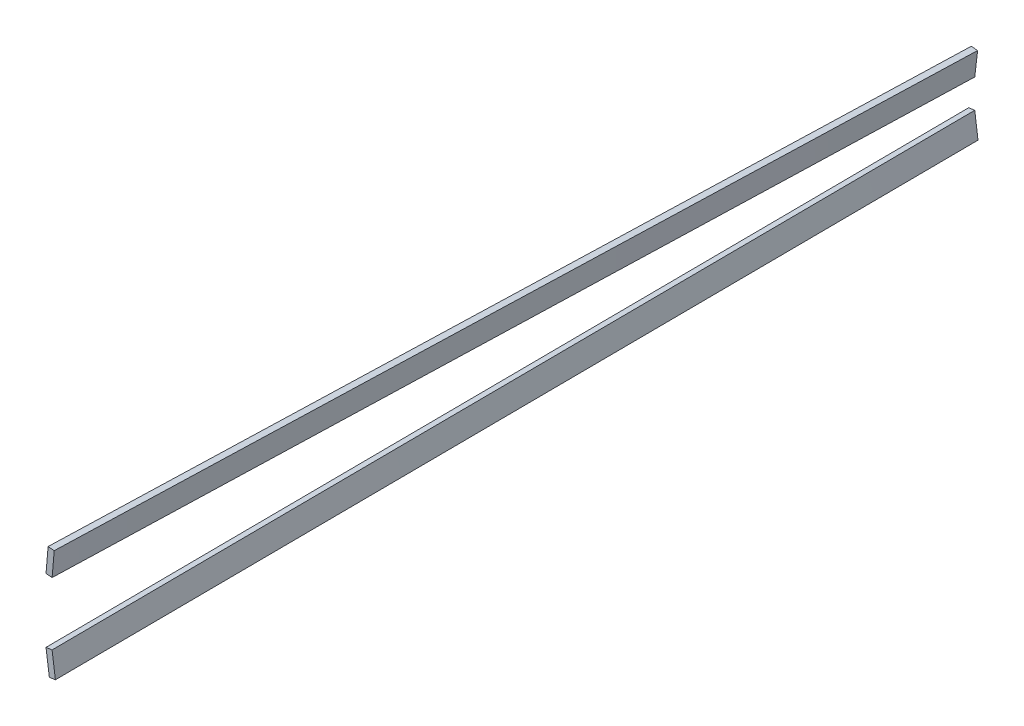
ISO-10303-21;
HEADER;
FILE_DESCRIPTION(('STEP AP214'),'2;1');
FILE_NAME('part.step','',(''),(''),'','','');
FILE_SCHEMA(('AUTOMOTIVE_DESIGN { 1 0 10303 214 1 1 1 1 }'));
ENDSEC;
DATA;
#1=APPLICATION_CONTEXT('core data for automotive mechanical design processes');
#2=APPLICATION_PROTOCOL_DEFINITION('international standard','automotive_design',2000,#1);
#3=PRODUCT_CONTEXT('',#1,'mechanical');
#4=PRODUCT('Part','Part','',(#3));
#5=PRODUCT_RELATED_PRODUCT_CATEGORY('part','',(#4));
#6=PRODUCT_DEFINITION_FORMATION('','',#4);
#7=PRODUCT_DEFINITION_CONTEXT('part definition',#1,'design');
#8=PRODUCT_DEFINITION('design','',#6,#7);
#9=PRODUCT_DEFINITION_SHAPE('','',#8);
#10=(LENGTH_UNIT() NAMED_UNIT(*) SI_UNIT(.MILLI.,.METRE.));
#11=(NAMED_UNIT(*) PLANE_ANGLE_UNIT() SI_UNIT($,.RADIAN.));
#12=(NAMED_UNIT(*) SI_UNIT($,.STERADIAN.) SOLID_ANGLE_UNIT());
#13=UNCERTAINTY_MEASURE_WITH_UNIT(LENGTH_MEASURE(1.E-05),#10,'distance_accuracy_value','');
#14=(GEOMETRIC_REPRESENTATION_CONTEXT(3) GLOBAL_UNCERTAINTY_ASSIGNED_CONTEXT((#13)) GLOBAL_UNIT_ASSIGNED_CONTEXT((#10,
#11,#12)) REPRESENTATION_CONTEXT('',''));
#15=CARTESIAN_POINT('',(0.,0.,0.));
#16=DIRECTION('',(0.,0.,1.));
#17=DIRECTION('',(1.,0.,0.));
#18=AXIS2_PLACEMENT_3D('',#15,#16,#17);
#19=CARTESIAN_POINT('',(0.,0.,-478.663));
#20=DIRECTION('',(0.,0.,-1.));
#21=DIRECTION('',(-1.,0.,0.));
#22=AXIS2_PLACEMENT_3D('',#19,#20,#21);
#23=PLANE('',#22);
#24=DIRECTION('',(0.99120712690939,0.132319430032148,0.));
#25=VECTOR('',#24,1.);
#26=CARTESIAN_POINT('',(3.15823560704575,-23.6583972694122,-478.663));
#27=LINE('',#26,#25);
#28=CARTESIAN_POINT('',(293.325645427331,15.0769843062237,-478.663));
#29=VERTEX_POINT('',#28);
#30=CARTESIAN_POINT('',(296.472728055268,15.4970984965758,-478.663));
#31=VERTEX_POINT('',#30);
#32=EDGE_CURVE('E236',#29,#31,#27,.T.);
#33=ORIENTED_EDGE('',*,*,#32,.T.);
#34=DIRECTION('',(0.131985681946742,-0.991251622828963,0.));
#35=VECTOR('',#34,1.);
#36=CARTESIAN_POINT('',(293.335609063056,39.0577927034886,-478.663));
#37=LINE('',#36,#35);
#38=CARTESIAN_POINT('',(298.149010473727,2.90772029199698,-478.663));
#39=VERTEX_POINT('',#38);
#40=EDGE_CURVE('E141',#31,#39,#37,.T.);
#41=ORIENTED_EDGE('',*,*,#40,.T.);
#42=CARTESIAN_POINT('',(423.387562730416,-0.598570683459927,-478.663));
#43=CARTESIAN_POINT('',(423.353927756293,-0.591395979490775,-478.663));
#44=CARTESIAN_POINT('',(423.21931714752,-0.562682079919149,-478.663));
#45=CARTESIAN_POINT('',(422.91635344577,-0.499447587671617,-478.663));
#46=CARTESIAN_POINT('',(422.412228818172,-0.393180215829817,-478.663));
#47=CARTESIAN_POINT('',(421.70748859617,-0.247042835446236,-478.663));
#48=CARTESIAN_POINT('',(420.803524813709,-0.0608019669566655,-478.663));
#49=CARTESIAN_POINT('',(419.701710383377,0.162485176428392,-478.663));
#50=CARTESIAN_POINT('',(418.403969401873,0.42193723491887,-478.663));
#51=CARTESIAN_POINT('',(416.912204339275,0.713898906283567,-478.663));
#52=CARTESIAN_POINT('',(415.229189009072,1.03708195332995,-478.663));
#53=CARTESIAN_POINT('',(413.357174388221,1.38616016731921,-478.663));
#54=CARTESIAN_POINT('',(411.299857620068,1.75939956386392,-478.663));
#55=CARTESIAN_POINT('',(409.060092771815,2.15209085915427,-478.663));
#56=CARTESIAN_POINT('',(406.641766459114,2.56039912737651,-478.663));
#57=CARTESIAN_POINT('',(404.04866688,2.98050952034267,-478.663));
#58=CARTESIAN_POINT('',(401.284982811694,3.40684602860176,-478.663));
#59=CARTESIAN_POINT('',(398.355056245213,3.83534149622065,-478.663));
#60=CARTESIAN_POINT('',(395.263527571514,4.26052524747009,-478.663));
#61=CARTESIAN_POINT('',(392.015373204561,4.67808858830662,-478.663));
#62=CARTESIAN_POINT('',(388.615478958681,5.08116931638825,-478.663));
#63=CARTESIAN_POINT('',(385.069286638117,5.46711366951576,-478.663));
#64=CARTESIAN_POINT('',(381.381970635892,5.82783453396013,-478.663));
#65=CARTESIAN_POINT('',(377.559192932435,6.15921060948389,-478.663));
#66=CARTESIAN_POINT('',(373.606851586853,6.45639091976692,-478.663));
#67=CARTESIAN_POINT('',(369.530453947723,6.71243770640048,-478.663));
#68=CARTESIAN_POINT('',(365.336119949899,6.92357395440403,-478.663));
#69=CARTESIAN_POINT('',(361.029807140813,7.08404404844039,-478.663));
#70=CARTESIAN_POINT('',(356.617523340991,7.18843396947195,-478.663));
#71=CARTESIAN_POINT('',(352.105426545498,7.23205813156872,-478.663));
#72=CARTESIAN_POINT('',(347.499385223467,7.21140010703142,-478.663));
#73=CARTESIAN_POINT('',(342.80568645406,7.11987185636663,-478.663));
#74=CARTESIAN_POINT('',(338.030192719595,6.95515066970667,-478.663));
#75=CARTESIAN_POINT('',(333.178936205884,6.71234985379041,-478.663));
#76=CARTESIAN_POINT('',(328.257698607244,6.38807962814831,-478.663));
#77=CARTESIAN_POINT('',(323.272118603679,5.98002284945519,-478.663));
#78=CARTESIAN_POINT('',(318.228182783313,5.48230898932139,-478.663));
#79=CARTESIAN_POINT('',(313.120651689801,4.89918891009641,-478.663));
#80=CARTESIAN_POINT('',(307.869311436917,4.18787475782382,-478.663));
#81=CARTESIAN_POINT('',(302.45646596458,3.48111483212754,-478.663));
#82=CARTESIAN_POINT('',(296.896259161603,2.74127410511817,-478.663));
#83=CARTESIAN_POINT('',(291.277526125806,1.99080851277614,-478.663));
#84=CARTESIAN_POINT('',(285.605919767471,1.22943621224605,-478.663));
#85=CARTESIAN_POINT('',(279.887290637041,0.457639017885714,-478.663));
#86=CARTESIAN_POINT('',(274.127034046233,-0.323609112130179,-478.663));
#87=CARTESIAN_POINT('',(268.330669910689,-1.11197613327778,-478.663));
#88=CARTESIAN_POINT('',(262.503543084913,-1.90586372829593,-478.663));
#89=CARTESIAN_POINT('',(256.651521274952,-2.70536888716537,-478.663));
#90=CARTESIAN_POINT('',(250.779899054847,-3.50651782193096,-478.663));
#91=CARTESIAN_POINT('',(244.894427750941,-4.30923724123935,-478.663));
#92=CARTESIAN_POINT('',(239.000567191879,-5.11132357461406,-478.663));
#93=CARTESIAN_POINT('',(233.103498264235,-5.90945278003363,-478.663));
#94=CARTESIAN_POINT('',(227.208964765834,-6.70337919450948,-478.663));
#95=CARTESIAN_POINT('',(221.322423209652,-7.49063506944608,-478.663));
#96=CARTESIAN_POINT('',(215.448997430527,-8.26717151250937,-478.663));
#97=CARTESIAN_POINT('',(209.594351574101,-9.03362813673483,-478.663));
#98=CARTESIAN_POINT('',(203.763409799043,-9.78454417055984,-478.663));
#99=CARTESIAN_POINT('',(197.96163086993,-10.5200053400287,-478.663));
#100=CARTESIAN_POINT('',(192.194232926486,-11.2365486354174,-478.663));
#101=CARTESIAN_POINT('',(186.466038684059,-11.9314142369755,-478.663));
#102=CARTESIAN_POINT('',(180.782436918827,-12.603274502764,-478.663));
#103=CARTESIAN_POINT('',(175.148233734479,-13.2482933836929,-478.663));
#104=CARTESIAN_POINT('',(169.568575962817,-13.8653038852164,-478.663));
#105=CARTESIAN_POINT('',(164.048210174808,-14.4510142998016,-478.663));
#106=CARTESIAN_POINT('',(158.592053261258,-15.0035265840128,-478.663));
#107=CARTESIAN_POINT('',(153.204921249941,-15.5202417100007,-478.663));
#108=CARTESIAN_POINT('',(147.891468535792,-15.9995243592631,-478.663));
#109=CARTESIAN_POINT('',(142.656399146351,-16.4389751743704,-478.663));
#110=CARTESIAN_POINT('',(137.504278758819,-16.8360326338407,-478.663));
#111=CARTESIAN_POINT('',(132.439787601187,-17.1897064470047,-478.663));
#112=CARTESIAN_POINT('',(127.467323045722,-17.4971602641448,-478.663));
#113=CARTESIAN_POINT('',(122.591261031339,-17.7570314908688,-478.663));
#114=CARTESIAN_POINT('',(117.815974853389,-17.9684391095265,-478.663));
#115=CARTESIAN_POINT('',(113.145771879521,-18.1292556955295,-478.663));
#116=CARTESIAN_POINT('',(108.584868364175,-18.2375350386864,-478.663));
#117=CARTESIAN_POINT('',(104.137640996795,-18.2939630983556,-478.663));
#118=CARTESIAN_POINT('',(99.8078887735024,-18.2954225965007,-478.663));
#119=CARTESIAN_POINT('',(95.5998472131619,-18.2423038335932,-478.663));
#120=CARTESIAN_POINT('',(91.5173192139185,-18.1338093844727,-478.663));
#121=CARTESIAN_POINT('',(87.5643031381508,-17.9682478198103,-478.663));
#122=CARTESIAN_POINT('',(83.7445855660069,-17.746248509974,-478.663));
#123=CARTESIAN_POINT('',(80.061874223133,-17.4671075395393,-478.663));
#124=CARTESIAN_POINT('',(76.519839715575,-17.13063972547,-478.663));
#125=CARTESIAN_POINT('',(73.1219854837755,-16.7361212710426,-478.663));
#126=CARTESIAN_POINT('',(69.8716450566022,-16.2843801388157,-478.663));
#127=CARTESIAN_POINT('',(66.7721547003917,-15.7751336760586,-478.663));
#128=CARTESIAN_POINT('',(63.8267343373244,-15.2086669368191,-478.663));
#129=CARTESIAN_POINT('',(61.0385935681709,-14.5844044129643,-478.663));
#130=CARTESIAN_POINT('',(58.4104140498924,-13.9039395891707,-478.663));
#131=CARTESIAN_POINT('',(55.9451842927062,-13.1663213913398,-478.663));
#132=CARTESIAN_POINT('',(53.6452481034751,-12.3733473758183,-478.663));
#133=CARTESIAN_POINT('',(51.513417248505,-11.5238097949324,-478.663));
#134=CARTESIAN_POINT('',(49.5520143575696,-10.6188443549477,-478.663));
#135=CARTESIAN_POINT('',(47.7628278881901,-9.65873376201667,-478.663));
#136=CARTESIAN_POINT('',(46.147868828537,-8.64407502954019,-478.663));
#137=CARTESIAN_POINT('',(44.7094832235471,-7.57379097901466,-478.663));
#138=CARTESIAN_POINT('',(43.4495535636796,-6.44836880629533,-478.663));
#139=CARTESIAN_POINT('',(42.3693155768158,-5.26841350717316,-478.663));
#140=CARTESIAN_POINT('',(41.4711549763534,-4.03269789142648,-478.663));
#141=CARTESIAN_POINT('',(40.7610437619866,-2.74155962108168,-478.663));
#142=CARTESIAN_POINT('',(40.2240782562071,-1.39842829488874,-478.663));
#143=CARTESIAN_POINT('',(40.026437002402,-0.465429755628102,-478.663));
#144=CARTESIAN_POINT('',(39.9278429354344,0.,-478.663));
#145=B_SPLINE_CURVE_WITH_KNOTS('',3,(#42,#43,#44,#45,#46,#47,#48,#49,#50,#51,#52,#53,#54,#55,
#56,#57,#58,#59,#60,#61,#62,#63,#64,#65,#66,#67,#68,#69,#70,#71,#72,#73,#74,#75,#76,#77,#78,#79,
#80,#81,#82,#83,#84,#85,#86,#87,#88,#89,#90,#91,#92,#93,#94,#95,#96,#97,#98,#99,#100,#101,#102,
#103,#104,#105,#106,#107,#108,#109,#110,#111,#112,#113,#114,#115,#116,#117,#118,#119,#120,#121,
#122,#123,#124,#125,#126,#127,#128,#129,#130,#131,#132,#133,#134,#135,#136,#137,#138,#139,#140,
#141,#142,#143,#144),.UNSPECIFIED.,.F.,.F.,(4,1,1,1,1,1,1,1,1,1,1,1,1,1,1,1,1,1,1,1,1,1,1,1,1,1,
1,1,1,1,1,1,1,1,1,1,1,1,1,1,1,1,1,1,1,1,1,1,1,1,1,1,1,1,1,1,1,1,1,1,1,1,1,1,1,1,1,1,1,1,1,1,1,1,
1,1,1,1,1,1,1,1,1,1,1,1,1,1,1,1,1,1,1,1,1,1,1,1,1,1,4),(0.,0.000263407441861152,
0.00105418354046938,0.002370412180423,0.00420937424793744,0.00656664230364534,
0.00943932529828362,0.012819753789679,0.0167027815540403,0.0210815676778737,0.0259455150023407,
0.0312877118873262,0.0370957960416438,0.0433615353737737,0.0500718116741128,0.0572152612400396,
0.0647788957380719,0.0727507221098705,0.0811160233175952,0.0898610226345078,0.0989726352727727,
0.108436394956907,0.11823658628776,0.128360674312887,0.138792302715597,0.149518641338252,
0.160525099370816,0.171796475500045,0.183320915835009,0.195083958581768,0.207073471204003,
0.219275662182765,0.231680048251389,0.244274442260697,0.257047871769566,0.269990725638771,
0.283092436221423,0.296418175051444,0.310577141849346,0.324901812537067,0.339379315631893,
0.353993476069731,0.368730577460443,0.383575671255915,0.398515484082567,0.413533959391771,
0.428618215440677,0.44375276659731,0.458921685899164,0.474112665452042,0.489310225086662,
0.504499416623933,0.519666846056783,0.534796932326458,0.549875724286475,0.564890467250726,
0.579825176535041,0.594667406411289,0.609402807723467,0.624019253145754,0.638501397294299,
0.652837209492562,0.667014500967881,0.68101931479257,0.694839720321596,0.708463964765985,
0.721880297346092,0.735076105433477,0.748040996187331,0.760763583019831,0.773232750583482,
0.785439521795172,0.797373026110578,0.80902262678145,0.820380871717842,0.83143652712263,
0.842183519415127,0.852612082472283,0.86271472951419,0.872485157300502,0.881915470474977,
0.891000132552545,0.899734087744223,0.908112589055665,0.916131607778471,0.923788842688074,
0.931081963902189,0.938011213981012,0.944577653857526,0.950785321002633,0.956638125291176,
0.962146840114847,0.967320917546812,0.972179373952079,0.9767415246109,0.981036728216416,
0.985098918921906,0.988971863590748,0.992706768868038,0.996361744803825,1.),.UNSPECIFIED.);
#146=CARTESIAN_POINT('',(295.006102188739,2.48865379447443,-478.663));
#147=VERTEX_POINT('',#146);
#148=EDGE_CURVE('E99',#39,#147,#145,.T.);
#149=ORIENTED_EDGE('',*,*,#148,.T.);
#150=DIRECTION('',(-0.132319430032147,0.99120712690939,0.));
#151=VECTOR('',#150,1.);
#152=CARTESIAN_POINT('',(290.167409820285,38.7353815756355,-478.663));
#153=LINE('',#152,#151);
#154=EDGE_CURVE('E13',#147,#29,#153,.T.);
#155=ORIENTED_EDGE('',*,*,#154,.T.);
#156=EDGE_LOOP('',(#33,#41,#149,#155));
#157=FACE_BOUND('',#156,.T.);
#158=ADVANCED_FACE('F89',(#157),#23,.T.);
#159=CARTESIAN_POINT('',(0.,0.,0.));
#160=DIRECTION('',(0.,0.,1.));
#161=DIRECTION('',(1.,0.,0.));
#162=AXIS2_PLACEMENT_3D('',#159,#160,#161);
#163=PLANE('',#162);
#164=DIRECTION('',(-0.134658441587376,0.99089207490486,0.));
#165=VECTOR('',#164,1.);
#166=CARTESIAN_POINT('',(289.604328188599,39.3561201047853,0.));
#167=LINE('',#166,#165);
#168=CARTESIAN_POINT('',(295.036807925605,-0.619102057485672,0.));
#169=VERTEX_POINT('',#168);
#170=CARTESIAN_POINT('',(293.326645717445,11.965227293806,0.));
#171=VERTEX_POINT('',#170);
#172=EDGE_CURVE('E203',#169,#171,#167,.T.);
#173=ORIENTED_EDGE('',*,*,#172,.F.);
#174=CARTESIAN_POINT('',(272.758362456909,-3.65581401828483,0.));
#175=CARTESIAN_POINT('',(273.323038862609,-3.57873827863166,0.));
#176=CARTESIAN_POINT('',(276.358796537806,-3.16431991771855,0.));
#177=CARTESIAN_POINT('',(281.854781180959,-2.41345663349635,0.));
#178=CARTESIAN_POINT('',(289.233859631028,-1.40813120619887,0.));
#179=CARTESIAN_POINT('',(296.573982386272,-0.409796640262891,0.));
#180=CARTESIAN_POINT('',(303.868380953239,0.579522999615512,0.));
#181=CARTESIAN_POINT('',(311.110065241189,1.55687474975404,0.));
#182=CARTESIAN_POINT('',(318.292203182046,2.52102495297771,0.));
#183=CARTESIAN_POINT('',(325.4073859189,3.47136371656061,0.));
#184=CARTESIAN_POINT('',(332.44845494126,4.40824789663675,0.));
#185=CARTESIAN_POINT('',(339.302915498252,5.30324075895215,0.));
#186=CARTESIAN_POINT('',(345.952856872452,6.20400082385384,0.));
#187=CARTESIAN_POINT('',(352.420688138379,6.94242450405157,0.));
#188=CARTESIAN_POINT('',(358.807986620489,7.57269564144798,0.));
#189=CARTESIAN_POINT('',(365.121387221388,8.08943105349519,0.));
#190=CARTESIAN_POINT('',(371.353308902841,8.50006492072197,0.));
#191=CARTESIAN_POINT('',(377.49661131128,8.80753139498866,0.));
#192=CARTESIAN_POINT('',(383.543972889456,9.01612314573799,0.));
#193=CARTESIAN_POINT('',(389.48775494647,9.13202833224759,0.));
#194=CARTESIAN_POINT('',(395.32053355087,9.15818824511355,0.));
#195=CARTESIAN_POINT('',(401.034347101245,9.10294556265715,0.));
#196=CARTESIAN_POINT('',(406.621764276995,8.97075324664186,0.));
#197=CARTESIAN_POINT('',(412.074986887718,8.767544826529,0.));
#198=CARTESIAN_POINT('',(417.386407281049,8.50017614669937,0.));
#199=CARTESIAN_POINT('',(422.54848099331,8.17593591941227,0.));
#200=CARTESIAN_POINT('',(427.553458196633,7.7996068660397,0.));
#201=CARTESIAN_POINT('',(432.394364707136,7.37997464832547,0.));
#202=CARTESIAN_POINT('',(437.063731759505,6.92318223197591,0.));
#203=CARTESIAN_POINT('',(441.554389355166,6.43444848566638,0.));
#204=CARTESIAN_POINT('',(445.859785012227,5.92401425015461,0.));
#205=CARTESIAN_POINT('',(449.973027478112,5.39524044171832,0.));
#206=CARTESIAN_POINT('',(453.887929886094,4.85681652022216,0.));
#207=CARTESIAN_POINT('',(457.598190253226,4.3141988780929,0.));
#208=CARTESIAN_POINT('',(461.097932514302,3.77431529482507,0.));
#209=CARTESIAN_POINT('',(464.381658047561,3.24231589208937,0.));
#210=CARTESIAN_POINT('',(467.444062606876,2.72526199021861,0.));
#211=CARTESIAN_POINT('',(470.280349075582,2.22798434817506,0.));
#212=CARTESIAN_POINT('',(472.885595604198,1.75533932329177,0.));
#213=CARTESIAN_POINT('',(475.256188039839,1.31329025898222,0.));
#214=CARTESIAN_POINT('',(477.38744454002,0.90403319739814,0.));
#215=CARTESIAN_POINT('',(479.276514699606,0.534312721305988,0.));
#216=CARTESIAN_POINT('',(480.919885908922,0.205760172731364,0.));
#217=CARTESIAN_POINT('',(482.315149055207,-0.0769954375130829,0.));
#218=CARTESIAN_POINT('',(483.459867496382,-0.312838295328672,0.));
#219=CARTESIAN_POINT('',(484.352302675222,-0.497896753791792,0.));
#220=CARTESIAN_POINT('',(484.990691913051,-0.632466588116719,0.));
#221=CARTESIAN_POINT('',(485.374344699791,-0.712542464675102,0.));
#222=CARTESIAN_POINT('',(485.544806570126,-0.748903782973926,0.));
#223=CARTESIAN_POINT('',(485.587399664,-0.757989340000014,0.));
#224=B_SPLINE_CURVE_WITH_KNOTS('',3,(#174,#175,#176,#177,#178,#179,#180,#181,#182,#183,#184,
#185,#186,#187,#188,#189,#190,#191,#192,#193,#194,#195,#196,#197,#198,#199,#200,#201,#202,#203,
#204,#205,#206,#207,#208,#209,#210,#211,#212,#213,#214,#215,#216,#217,#218,#219,#220,#221,#222,
#223),.UNSPECIFIED.,.F.,.F.,(4,1,1,1,1,1,1,1,1,1,1,1,1,1,1,1,1,1,1,1,1,1,1,1,1,1,1,1,1,1,1,1,1,
1,1,1,1,1,1,1,1,1,1,1,1,1,1,4),(0.567934832207434,0.571381784609285,0.586466040212324,
0.601484515504651,0.616424328656068,0.631269422567314,0.646006523660011,0.660620684024748,
0.675098187725839,0.689422858106043,0.70358182449163,0.716907563519481,0.730009274307503,
0.742952128081458,0.755725557616091,0.768319951608713,0.780724337258785,0.792926528422221,
0.804916041149194,0.816679083952964,0.828203524457021,0.839474900250967,0.850481358571424,
0.861207696842428,0.871639325898208,0.881763413748535,0.891563604612636,0.901027364470059,
0.910138977259583,0.918883976165486,0.927249277819328,0.935221103617664,0.94278473843867,
0.949928187937218,0.956638464326096,0.962904203571485,0.968712287841806,0.974054485103458,
0.978918431944735,0.983297218245018,0.987180245995965,0.990560674272218,0.993433357470946,
0.995790625593699,0.997629587292661,0.998945815779481,0.99973659231019,1.),.UNSPECIFIED.);
#225=CARTESIAN_POINT('',(298.182924105385,-0.19181053348416,0.));
#226=VERTEX_POINT('',#225);
#227=EDGE_CURVE('E161',#169,#226,#224,.T.);
#228=ORIENTED_EDGE('',*,*,#227,.T.);
#229=DIRECTION('',(0.134658441587371,-0.990892074904861,0.));
#230=VECTOR('',#229,1.);
#231=CARTESIAN_POINT('',(292.750410526422,39.7836606568238,0.));
#232=LINE('',#231,#230);
#233=CARTESIAN_POINT('',(296.472728055268,12.392767845846,0.));
#234=VERTEX_POINT('',#233);
#235=EDGE_CURVE('E137',#234,#226,#232,.T.);
#236=ORIENTED_EDGE('',*,*,#235,.F.);
#237=DIRECTION('',(0.99089207490486,0.13465844158738,0.));
#238=VECTOR('',#237,1.);
#239=CARTESIAN_POINT('',(3.72231752884665,-27.3908928109804,0.));
#240=LINE('',#239,#238);
#241=EDGE_CURVE('E148',#171,#234,#240,.T.);
#242=ORIENTED_EDGE('',*,*,#241,.F.);
#243=EDGE_LOOP('',(#173,#228,#236,#242));
#244=FACE_BOUND('',#243,.T.);
#245=ADVANCED_FACE('F160',(#244),#163,.T.);
#246=CARTESIAN_POINT('',(295.036807925605,-0.619102057485672,0.));
#247=CARTESIAN_POINT('',(295.006102188739,2.48865379447442,-478.663));
#248=CARTESIAN_POINT('',(294.751780890912,1.47828616772958,0.));
#249=CARTESIAN_POINT('',(294.726026061838,4.58670887976591,-478.663));
#250=CARTESIAN_POINT('',(294.466753856218,3.57567439294485,0.));
#251=CARTESIAN_POINT('',(294.445949934936,6.68476396505743,-478.663));
#252=CARTESIAN_POINT('',(293.896699786832,7.77045084337541,0.));
#253=CARTESIAN_POINT('',(293.885797681134,10.8808741356405,-478.663));
#254=CARTESIAN_POINT('',(293.611672752139,9.86783906859072,0.));
#255=CARTESIAN_POINT('',(293.605721554232,12.9789292209321,-478.663));
#256=CARTESIAN_POINT('',(293.326645717445,11.965227293806,0.));
#257=CARTESIAN_POINT('',(293.325645427331,15.0769843062237,-478.663));
#258=B_SPLINE_SURFACE_WITH_KNOTS('',3,1,((#246,#247),(#248,#249),(#250,#251),(#252,#253),(#254,
#255),(#256,#257)),.UNSPECIFIED.,.F.,.F.,.F.,(4,2,4),(2,2),(0.,0.5,1.),(0.,1.),.UNSPECIFIED.);
#259=DIRECTION('',(-2.08971442928665E-06,0.00650079755426387,-0.999978869590149));
#260=VECTOR('',#259,1.);
#261=CARTESIAN_POINT('',(293.326145572388,13.5211058000149,-239.3315));
#262=LINE('',#261,#260);
#263=EDGE_CURVE('E145',#171,#29,#262,.T.);
#264=DIRECTION('',(6.4147614595899E-05,-0.00649243903577054,0.999978921838081));
#265=VECTOR('',#264,1.);
#266=CARTESIAN_POINT('',(295.021455057172,0.934775868494372,-239.3315));
#267=LINE('',#266,#265);
#268=EDGE_CURVE('E114',#147,#169,#267,.T.);
#269=ORIENTED_EDGE('',*,*,#172,.T.);
#270=ORIENTED_EDGE('',*,*,#263,.T.);
#271=ORIENTED_EDGE('',*,*,#154,.F.);
#272=ORIENTED_EDGE('',*,*,#268,.T.);
#273=EDGE_LOOP('',(#269,#270,#271,#272));
#274=FACE_BOUND('',#273,.T.);
#275=ADVANCED_FACE('F180',(#274),#258,.T.);
#276=CARTESIAN_POINT('',(293.326645717445,11.9652272938061,0.));
#277=CARTESIAN_POINT('',(293.325645427331,15.0769843062237,-478.663));
#278=CARTESIAN_POINT('',(293.850992773749,12.0364840524794,0.));
#279=CARTESIAN_POINT('',(293.850159198654,15.1470033379491,-478.663));
#280=CARTESIAN_POINT('',(294.375339830053,12.1077408111527,0.));
#281=CARTESIAN_POINT('',(294.374672969977,15.2170223696745,-478.663));
#282=CARTESIAN_POINT('',(295.424033942661,12.2502543284993,0.));
#283=CARTESIAN_POINT('',(295.423700512623,15.3570604331252,-478.663));
#284=CARTESIAN_POINT('',(295.948380998964,12.3215110871727,0.));
#285=CARTESIAN_POINT('',(295.948214283946,15.4270794648505,-478.663));
#286=CARTESIAN_POINT('',(296.472728055268,12.392767845846,0.));
#287=CARTESIAN_POINT('',(296.472728055268,15.4970984965758,-478.663));
#288=B_SPLINE_SURFACE_WITH_KNOTS('',3,1,((#276,#277),(#278,#279),(#280,#281),(#282,#283),(#284,
#285),(#286,#287)),.UNSPECIFIED.,.F.,.F.,.F.,(4,2,4),(2,2),(0.,0.5,1.),(0.,1.),.UNSPECIFIED.);
#289=DIRECTION('',(0.,0.00648528373337653,-0.999978970326325));
#290=VECTOR('',#289,1.);
#291=CARTESIAN_POINT('',(296.472728055268,13.9449331712109,-239.3315));
#292=LINE('',#291,#290);
#293=EDGE_CURVE('E132',#234,#31,#292,.T.);
#294=ORIENTED_EDGE('',*,*,#241,.T.);
#295=ORIENTED_EDGE('',*,*,#293,.T.);
#296=ORIENTED_EDGE('',*,*,#32,.F.);
#297=ORIENTED_EDGE('',*,*,#263,.F.);
#298=EDGE_LOOP('',(#294,#295,#296,#297));
#299=FACE_BOUND('',#298,.T.);
#300=ADVANCED_FACE('F150',(#299),#288,.T.);
#301=CARTESIAN_POINT('',(298.182924105385,-0.191810533484172,0.));
#302=CARTESIAN_POINT('',(298.149010464063,2.90772029071021,-478.663000000001));
#303=CARTESIAN_POINT('',(297.77153606111,-0.247647448198452,0.));
#304=CARTESIAN_POINT('',(297.738036460832,2.85299888311781,-478.663));
#305=CARTESIAN_POINT('',(297.240415087317,-0.319755450715439,0.));
#306=CARTESIAN_POINT('',(297.207454639919,2.78229599082885,-478.663000000001));
#307=CARTESIAN_POINT('',(296.191708765441,-0.46217914367285,0.));
#308=CARTESIAN_POINT('',(296.159817101399,2.64261733002786,-478.663000000001));
#309=CARTESIAN_POINT('',(295.554390311453,-0.548764591644108,0.));
#310=CARTESIAN_POINT('',(295.523151527565,2.55767637507806,-478.663000000001));
#311=CARTESIAN_POINT('',(295.036807925605,-0.619102057485676,0.));
#312=CARTESIAN_POINT('',(295.006102188739,2.48865379447443,-478.663));
#313=B_SPLINE_SURFACE_WITH_KNOTS('',3,1,((#301,#302),(#303,#304),(#305,#306),(#307,#308),(#309,
#310),(#311,#312)),.UNSPECIFIED.,.F.,.F.,.F.,(4,1,1,4),(2,2),(0.,0.392277227659318,
0.506450563931673,1.),(0.,1.),.UNSPECIFIED.);
#314=DIRECTION('',(-7.08492626011175E-05,0.00647525678187677,-0.999979032795183));
#315=VECTOR('',#314,1.);
#316=CARTESIAN_POINT('',(298.165967289556,1.35795487925641,-239.3315));
#317=LINE('',#316,#315);
#318=EDGE_CURVE('E144',#226,#39,#317,.T.);
#319=ORIENTED_EDGE('',*,*,#227,.F.);
#320=ORIENTED_EDGE('',*,*,#268,.F.);
#321=ORIENTED_EDGE('',*,*,#148,.F.);
#322=ORIENTED_EDGE('',*,*,#318,.F.);
#323=EDGE_LOOP('',(#319,#320,#321,#322));
#324=FACE_BOUND('',#323,.T.);
#325=ADVANCED_FACE('F248',(#324),#313,.T.);
#326=CARTESIAN_POINT('',(296.472728055268,12.392767845846,0.));
#327=CARTESIAN_POINT('',(296.472728055268,15.4970984965758,-478.663));
#328=CARTESIAN_POINT('',(296.757760730288,10.2953381159576,0.));
#329=CARTESIAN_POINT('',(296.752108458345,13.3988687958126,-478.663));
#330=CARTESIAN_POINT('',(297.042793405307,8.19790838606931,0.));
#331=CARTESIAN_POINT('',(297.031488861421,11.3006390950495,-478.663));
#332=CARTESIAN_POINT('',(297.612858755346,4.0030489262926,0.));
#333=CARTESIAN_POINT('',(297.590249667574,7.10417969352324,-478.663));
#334=CARTESIAN_POINT('',(297.897891430366,1.90561919640423,0.));
#335=CARTESIAN_POINT('',(297.86963007065,5.00594999276011,-478.663));
#336=CARTESIAN_POINT('',(298.182924105385,-0.19181053348416,0.));
#337=CARTESIAN_POINT('',(298.149010473727,2.90772029199698,-478.663));
#338=B_SPLINE_SURFACE_WITH_KNOTS('',3,1,((#326,#327),(#328,#329),(#330,#331),(#332,#333),(#334,
#335),(#336,#337)),.UNSPECIFIED.,.F.,.F.,.F.,(4,2,4),(2,2),(0.,0.5,1.),(0.,1.),.UNSPECIFIED.);
#339=ORIENTED_EDGE('',*,*,#235,.T.);
#340=ORIENTED_EDGE('',*,*,#318,.T.);
#341=ORIENTED_EDGE('',*,*,#40,.F.);
#342=ORIENTED_EDGE('',*,*,#293,.F.);
#343=EDGE_LOOP('',(#339,#340,#341,#342));
#344=FACE_BOUND('',#343,.T.);
#345=ADVANCED_FACE('F134',(#344),#338,.T.);
#346=CLOSED_SHELL('',(#158,#245,#275,#300,#325,#345));
#347=MANIFOLD_SOLID_BREP('B2',#346);
#348=CARTESIAN_POINT('',(0.,0.,-478.663));
#349=DIRECTION('',(0.,0.,-1.));
#350=DIRECTION('',(-1.,0.,0.));
#351=AXIS2_PLACEMENT_3D('',#348,#349,#350);
#352=PLANE('',#351);
#353=DIRECTION('',(0.115362470191797,0.993323462156838,0.));
#354=VECTOR('',#353,1.);
#355=CARTESIAN_POINT('',(289.037781570803,-33.5682320322562,-478.663));
#356=LINE('',#355,#354);
#357=CARTESIAN_POINT('',(296.472728055268,30.4500467946571,-478.663));
#358=VERTEX_POINT('',#357);
#359=CARTESIAN_POINT('',(297.937186245587,43.0596993760035,-478.663));
#360=VERTEX_POINT('',#359);
#361=EDGE_CURVE('E562',#358,#360,#356,.T.);
#362=ORIENTED_EDGE('',*,*,#361,.F.);
#363=DIRECTION('',(0.993725072979922,-0.111850254049998,0.));
#364=VECTOR('',#363,1.);
#365=CARTESIAN_POINT('',(7.09348997460711,63.0215720345871,-478.663));
#366=LINE('',#365,#364);
#367=CARTESIAN_POINT('',(293.317650948557,30.8051713512659,-478.663));
#368=VERTEX_POINT('',#367);
#369=EDGE_CURVE('E554',#368,#358,#366,.T.);
#370=ORIENTED_EDGE('',*,*,#369,.F.);
#371=DIRECTION('',(-0.111850254049959,-0.993725072979926,0.));
#372=VECTOR('',#371,1.);
#373=CARTESIAN_POINT('',(286.224160973954,-32.2164006833102,-478.663));
#374=LINE('',#373,#372);
#375=CARTESIAN_POINT('',(294.738149184402,43.4254797770516,-478.663000000001));
#376=VERTEX_POINT('',#375);
#377=EDGE_CURVE('E433',#376,#368,#374,.T.);
#378=ORIENTED_EDGE('',*,*,#377,.F.);
#379=CARTESIAN_POINT('',(39.9278429354344,0.,-478.663));
#380=CARTESIAN_POINT('',(39.8657355030388,0.471738861701327,-478.663));
#381=CARTESIAN_POINT('',(39.7412418233404,1.41733433207799,-478.663));
#382=CARTESIAN_POINT('',(39.8014992306979,2.86293780882031,-478.663));
#383=CARTESIAN_POINT('',(40.0435881073942,4.31743973085277,-478.663));
#384=CARTESIAN_POINT('',(40.4858457955378,5.78200614021087,-478.663));
#385=CARTESIAN_POINT('',(41.1210865702239,7.25447537763585,-478.663));
#386=CARTESIAN_POINT('',(41.9499403425719,8.73401937480033,-478.663));
#387=CARTESIAN_POINT('',(42.9705324204878,10.2195633421164,-478.663));
#388=CARTESIAN_POINT('',(44.1826856703149,11.7097016533522,-478.663));
#389=CARTESIAN_POINT('',(45.5848116190858,13.2032540866964,-478.663));
#390=CARTESIAN_POINT('',(47.1769606110042,14.6975906017416,-478.663));
#391=CARTESIAN_POINT('',(48.9568569531255,16.1916816805482,-478.663));
#392=CARTESIAN_POINT('',(50.9233741729635,17.6832523271647,-478.663));
#393=CARTESIAN_POINT('',(53.0758368025684,19.1685333153536,-478.663));
#394=CARTESIAN_POINT('',(55.4112771315268,20.6465924822314,-478.663));
#395=CARTESIAN_POINT('',(57.9287136524455,22.113680534508,-478.663));
#396=CARTESIAN_POINT('',(60.6257230087473,23.5670725709571,-478.663));
#397=CARTESIAN_POINT('',(63.4995976263182,25.0045399616052,-478.663));
#398=CARTESIAN_POINT('',(66.548289312539,26.4220553746558,-478.663));
#399=CARTESIAN_POINT('',(69.7683476016566,27.8180051184808,-478.663));
#400=CARTESIAN_POINT('',(73.1573670243377,29.1881334965629,-478.663));
#401=CARTESIAN_POINT('',(76.7113758901145,30.5305697748545,-478.663));
#402=CARTESIAN_POINT('',(80.4276517068769,31.8411783203375,-478.663));
#403=CARTESIAN_POINT('',(84.3016294259345,33.1190287102848,-478.663));
#404=CARTESIAN_POINT('',(88.3303811617404,34.3592759243895,-478.663));
#405=CARTESIAN_POINT('',(92.5092103588319,35.560557175507,-478.663));
#406=CARTESIAN_POINT('',(96.8338913079398,36.7201471301192,-478.663));
#407=CARTESIAN_POINT('',(101.300040036436,37.8352632841516,-478.663));
#408=CARTESIAN_POINT('',(105.902855534395,38.9038641890345,-478.663));
#409=CARTESIAN_POINT('',(110.637554275958,39.9240880593518,-478.663));
#410=CARTESIAN_POINT('',(115.49912431998,40.8928745770555,-478.663));
#411=CARTESIAN_POINT('',(120.482272730011,41.8099709327542,-478.663));
#412=CARTESIAN_POINT('',(125.581727333875,42.6726885051592,-478.663));
#413=CARTESIAN_POINT('',(130.791984372285,43.4801446390006,-478.663));
#414=CARTESIAN_POINT('',(136.107462486511,44.2300069495439,-478.663));
#415=CARTESIAN_POINT('',(141.522197574163,44.9226839958815,-478.663));
#416=CARTESIAN_POINT('',(147.030267001792,45.556817635471,-478.663));
#417=CARTESIAN_POINT('',(152.625767796557,46.1306036000922,-478.663));
#418=CARTESIAN_POINT('',(158.302470243132,46.6456024699738,-478.663));
#419=CARTESIAN_POINT('',(164.054425098867,47.0996675348524,-478.663));
#420=CARTESIAN_POINT('',(169.875312603121,47.4929196032938,-478.663));
#421=CARTESIAN_POINT('',(175.758650713526,47.8270105920672,-478.663));
#422=CARTESIAN_POINT('',(181.698057069012,48.0998114370645,-478.663));
#423=CARTESIAN_POINT('',(187.687028621125,48.3136066288164,-478.663));
#424=CARTESIAN_POINT('',(193.719089230696,48.4683035127761,-478.663));
#425=CARTESIAN_POINT('',(199.787843751074,48.5641907167495,-478.663));
#426=CARTESIAN_POINT('',(205.886629585358,48.6025809674322,-478.663));
#427=CARTESIAN_POINT('',(212.009060312847,48.5847923888063,-478.663));
#428=CARTESIAN_POINT('',(218.148480137534,48.511143258745,-478.663));
#429=CARTESIAN_POINT('',(224.298503089535,48.3836459075008,-478.663));
#430=CARTESIAN_POINT('',(230.452470262941,48.2031019295653,-478.663));
#431=CARTESIAN_POINT('',(236.603993634736,47.971241104442,-478.663));
#432=CARTESIAN_POINT('',(242.746541159821,47.6894630374681,-478.663));
#433=CARTESIAN_POINT('',(248.873720509852,47.3597092242678,-478.663));
#434=CARTESIAN_POINT('',(254.97931178675,46.9842795907467,-478.663));
#435=CARTESIAN_POINT('',(261.056811805734,46.5634558644705,-478.663));
#436=CARTESIAN_POINT('',(267.100212139501,46.1009377247458,-478.663));
#437=CARTESIAN_POINT('',(273.103140356113,45.5974376877133,-478.663));
#438=CARTESIAN_POINT('',(279.059787751442,45.0558088424675,-478.663));
#439=CARTESIAN_POINT('',(284.963964276411,44.4776394666588,-478.663));
#440=CARTESIAN_POINT('',(290.809692834341,43.8654249293648,-478.663));
#441=CARTESIAN_POINT('',(296.591174892215,43.221079634252,-478.663));
#442=CARTESIAN_POINT('',(302.302848338086,42.5482313391464,-478.663));
#443=CARTESIAN_POINT('',(308.023040549913,41.8319845725607,-478.663));
#444=CARTESIAN_POINT('',(313.755025892286,41.1016950367593,-478.663));
#445=CARTESIAN_POINT('',(319.470432002722,40.2237644065586,-478.663));
#446=CARTESIAN_POINT('',(325.077299289718,39.2468511060344,-478.663));
#447=CARTESIAN_POINT('',(330.560090670794,38.1717168139099,-478.663));
#448=CARTESIAN_POINT('',(335.914207797279,37.0090951990215,-478.663));
#449=CARTESIAN_POINT('',(341.135394770521,35.7659859399604,-478.663));
#450=CARTESIAN_POINT('',(346.219226346396,34.4507100000433,-478.663));
#451=CARTESIAN_POINT('',(351.162478322838,33.0728457650995,-478.663));
#452=CARTESIAN_POINT('',(355.961029875707,31.6394596211019,-478.663));
#453=CARTESIAN_POINT('',(360.612092961529,30.1598449561996,-478.663));
#454=CARTESIAN_POINT('',(365.112341598924,28.6420375822945,-478.663));
#455=CARTESIAN_POINT('',(369.459592657379,27.0958975362601,-478.663));
#456=CARTESIAN_POINT('',(373.650596368742,25.5281816759592,-478.663));
#457=CARTESIAN_POINT('',(377.683735784805,23.9490457256147,-478.663));
#458=CARTESIAN_POINT('',(381.55662308499,22.3656819419646,-478.663));
#459=CARTESIAN_POINT('',(385.267609436311,20.7871012786672,-478.663));
#460=CARTESIAN_POINT('',(388.814579937328,19.2201431565423,-478.663));
#461=CARTESIAN_POINT('',(392.196553962396,17.6745492247293,-478.663));
#462=CARTESIAN_POINT('',(395.411588669605,16.1566203231407,-478.663));
#463=CARTESIAN_POINT('',(398.458586597445,14.6744545288923,-478.663));
#464=CARTESIAN_POINT('',(401.33653268194,13.2354422030146,-478.663));
#465=CARTESIAN_POINT('',(404.044070071934,11.8455722171054,-478.663));
#466=CARTESIAN_POINT('',(406.580704943788,10.5125193998001,-478.663));
#467=CARTESIAN_POINT('',(408.945463813322,9.24201771246735,-478.663));
#468=CARTESIAN_POINT('',(411.13749988254,8.04052965266321,-478.663));
#469=CARTESIAN_POINT('',(413.156398271965,6.91348155799918,-478.663));
#470=CARTESIAN_POINT('',(415.001466379773,5.86623381100311,-478.663));
#471=CARTESIAN_POINT('',(416.671989481185,4.90306539209381,-478.663));
#472=CARTESIAN_POINT('',(418.167822287151,4.02942935997889,-478.663));
#473=CARTESIAN_POINT('',(419.4883951934,3.24886476384169,-478.663));
#474=CARTESIAN_POINT('',(420.633573027897,2.56502681173418,-478.663));
#475=CARTESIAN_POINT('',(421.603078349159,1.98114932230697,-478.663));
#476=CARTESIAN_POINT('',(422.396305995499,1.49912939924268,-478.663));
#477=CARTESIAN_POINT('',(423.013655169844,1.1223425168513,-478.663));
#478=CARTESIAN_POINT('',(423.454646277708,0.851788775395058,-478.663));
#479=CARTESIAN_POINT('',(423.719472788357,0.68934780641525,-478.663));
#480=CARTESIAN_POINT('',(423.837007337895,0.616740215475779,-478.663));
#481=CARTESIAN_POINT('',(423.866419521017,0.598570683459969,-478.663));
#482=B_SPLINE_CURVE_WITH_KNOTS('',3,(#379,#380,#381,#382,#383,#384,#385,#386,#387,#388,#389,
#390,#391,#392,#393,#394,#395,#396,#397,#398,#399,#400,#401,#402,#403,#404,#405,#406,#407,#408,
#409,#410,#411,#412,#413,#414,#415,#416,#417,#418,#419,#420,#421,#422,#423,#424,#425,#426,#427,
#428,#429,#430,#431,#432,#433,#434,#435,#436,#437,#438,#439,#440,#441,#442,#443,#444,#445,#446,
#447,#448,#449,#450,#451,#452,#453,#454,#455,#456,#457,#458,#459,#460,#461,#462,#463,#464,#465,
#466,#467,#468,#469,#470,#471,#472,#473,#474,#475,#476,#477,#478,#479,#480,#481),.UNSPECIFIED.,
.F.,.F.,(4,1,1,1,1,1,1,1,1,1,1,1,1,1,1,1,1,1,1,1,1,1,1,1,1,1,1,1,1,1,1,1,1,1,1,1,1,1,1,1,1,1,1,
1,1,1,1,1,1,1,1,1,1,1,1,1,1,1,1,1,1,1,1,1,1,1,1,1,1,1,1,1,1,1,1,1,1,1,1,1,1,1,1,1,1,1,1,1,1,1,1,
1,1,1,1,1,1,1,1,1,4),(0.,0.00349158406172634,0.00699884266753137,0.010584891001013,
0.0143057738060091,0.018212957002912,0.0223489592495324,0.0267500871703396,0.0314434001009153,
0.0364533478479211,0.0417951811298695,0.0474824739840348,0.053525220011689,0.0599287797612433,
0.0666973740748233,0.0738337467784175,0.0813392655292733,0.0892106143778258,0.0974471026699232,
0.106046574244149,0.11500228099912,0.124311157144941,0.133966165490781,0.1439621467403,
0.15429042880244,0.164945397634917,0.175917090581381,0.1871963143991,0.198776039986041,
0.21064431501338,0.222791848004837,0.235207958129106,0.247882413492289,0.260802286813156,
0.273957355243071,0.287334904946915,0.300921852482959,0.31470598609748,0.328674454147543,
0.342813945919347,0.357111324942549,0.371552525007795,0.38612316184337,0.400809007965877,
0.415596583076115,0.430470453895741,0.445417016025388,0.460420679976601,0.475467653540201,
0.490542167263301,0.505630260071093,0.520715991082178,0.535785217707677,0.550822734754853,
0.565813250446359,0.580743399202012,0.595596683292698,0.610359545464631,0.625017279453834,
0.639556130332767,0.653960323151271,0.668215888867977,0.682310773256923,0.696228800058483,
0.710585855975916,0.724777289727699,0.738723177380373,0.752412549480951,0.7658381692567,
0.778988406277182,0.791856444226357,0.804430395983943,0.81670230081389,0.828661874094511,
0.840300239924397,0.851606382109714,0.862571699525893,0.873185724038188,0.883438426750839,
0.893321888193432,0.902824243446795,0.911937089713061,0.920650173378921,0.928954175605772,
0.936839815793609,0.944298335730914,0.951321935831775,0.957900477144578,0.96402779434212,
0.969693763215075,0.974894023689597,0.979620339179358,0.983865976398503,0.987625510061292,
0.990894725538664,0.993669018208423,0.995943422630923,0.997716640851334,0.998984626496478,
0.999745910019303,1.),.UNSPECIFIED.);
#483=EDGE_CURVE('E87',#376,#360,#482,.T.);
#484=ORIENTED_EDGE('',*,*,#483,.T.);
#485=EDGE_LOOP('',(#362,#370,#378,#484));
#486=FACE_BOUND('',#485,.T.);
#487=ADVANCED_FACE('F423',(#486),#352,.T.);
#488=CARTESIAN_POINT('',(0.,0.,0.));
#489=DIRECTION('',(0.,0.,1.));
#490=DIRECTION('',(1.,0.,0.));
#491=AXIS2_PLACEMENT_3D('',#488,#489,#490);
#492=PLANE('',#491);
#493=DIRECTION('',(0.0862609880201649,0.996272574121051,0.));
#494=VECTOR('',#493,1.);
#495=CARTESIAN_POINT('',(290.409557049172,-25.1447404779369,0.));
#496=LINE('',#495,#494);
#497=CARTESIAN_POINT('',(296.472728055268,44.8819439389783,0.));
#498=VERTEX_POINT('',#497);
#499=CARTESIAN_POINT('',(297.567841990426,57.529978747974,0.));
#500=VERTEX_POINT('',#499);
#501=EDGE_CURVE('E531',#498,#500,#496,.T.);
#502=ORIENTED_EDGE('',*,*,#501,.T.);
#503=CARTESIAN_POINT('',(486.193791136,0.757989339999986,0.));
#504=CARTESIAN_POINT('',(486.156545565361,0.780998011435036,0.));
#505=CARTESIAN_POINT('',(486.007707870909,0.872943377020896,0.));
#506=CARTESIAN_POINT('',(485.672349581762,1.07864763611412,0.));
#507=CARTESIAN_POINT('',(485.113908291829,1.42125843999752,0.));
#508=CARTESIAN_POINT('',(484.332139179152,1.89839593924907,0.));
#509=CARTESIAN_POINT('',(483.327649378144,2.50879319131129,0.));
#510=CARTESIAN_POINT('',(482.099933618061,3.24817605291873,0.));
#511=CARTESIAN_POINT('',(480.649758177878,4.11414228025912,0.));
#512=CARTESIAN_POINT('',(478.977474041683,5.10259617373777,0.));
#513=CARTESIAN_POINT('',(477.083252711746,6.20890972510926,0.));
#514=CARTESIAN_POINT('',(474.967815399541,7.4286009034661,0.));
#515=CARTESIAN_POINT('',(472.631346146374,8.75476446910173,0.));
#516=CARTESIAN_POINT('',(470.074750091032,10.1819817066978,0.));
#517=CARTESIAN_POINT('',(467.298904376365,11.7034648979433,0.));
#518=CARTESIAN_POINT('',(464.304334104304,13.3123421553702,0.));
#519=CARTESIAN_POINT('',(461.092111508869,15.000429680272,0.));
#520=CARTESIAN_POINT('',(457.66346974577,16.7604670076838,0.));
#521=CARTESIAN_POINT('',(454.0190338335,18.5827346953726,0.));
#522=CARTESIAN_POINT('',(450.160522055661,20.4596487633212,0.));
#523=CARTESIAN_POINT('',(446.089220059658,22.3818513690475,0.));
#524=CARTESIAN_POINT('',(441.806517314033,24.3390865091975,0.));
#525=CARTESIAN_POINT('',(437.314874313997,26.3233762300568,0.));
#526=CARTESIAN_POINT('',(432.615532728645,28.3223837017805,0.));
#527=CARTESIAN_POINT('',(427.711170693804,30.3274484059496,0.));
#528=CARTESIAN_POINT('',(422.603876176864,32.3271589303653,0.));
#529=CARTESIAN_POINT('',(417.296673201285,34.3124081928799,0.));
#530=CARTESIAN_POINT('',(411.791609238653,36.2703351275022,0.));
#531=CARTESIAN_POINT('',(406.092799426548,38.1923836204457,0.));
#532=CARTESIAN_POINT('',(400.203008280872,40.0660671875782,0.));
#533=CARTESIAN_POINT('',(394.126447784507,41.8812102987039,0.));
#534=CARTESIAN_POINT('',(387.866648542298,43.6260442111925,0.));
#535=CARTESIAN_POINT('',(381.428828749611,45.2916204870301,0.));
#536=CARTESIAN_POINT('',(374.817071410062,46.865809767724,0.));
#537=CARTESIAN_POINT('',(368.03698039514,48.3380750058247,0.));
#538=CARTESIAN_POINT('',(361.093945074783,49.699552264347,0.));
#539=CARTESIAN_POINT('',(353.993788332329,50.9366490018386,0.));
#540=CARTESIAN_POINT('',(346.756185399731,52.0484008148347,0.));
#541=CARTESIAN_POINT('',(339.49758769736,52.9731900404694,0.));
#542=CARTESIAN_POINT('',(332.253923966388,53.8801963966564,0.));
#543=CARTESIAN_POINT('',(325.021047815005,54.7322458465364,0.));
#544=CARTESIAN_POINT('',(317.699770737049,55.5482010808888,0.));
#545=CARTESIAN_POINT('',(310.297136308343,56.3234680857997,0.));
#546=CARTESIAN_POINT('',(302.820487344147,57.0556225387862,0.));
#547=CARTESIAN_POINT('',(295.277392797908,57.7415046826616,0.));
#548=CARTESIAN_POINT('',(287.675691416606,58.3791029639876,0.));
#549=CARTESIAN_POINT('',(280.022738791621,58.9648045978675,0.));
#550=CARTESIAN_POINT('',(272.326604726296,59.4977071844643,0.));
#551=CARTESIAN_POINT('',(264.594897726286,59.9731259153054,0.));
#552=CARTESIAN_POINT('',(256.835853078089,60.3907037202014,0.));
#553=CARTESIAN_POINT('',(249.057347189727,60.7475284214375,0.));
#554=CARTESIAN_POINT('',(241.267474913243,61.0411412461608,0.));
#555=CARTESIAN_POINT('',(233.474507977737,61.2697698609126,0.));
#556=CARTESIAN_POINT('',(225.68653574506,61.431223872975,0.));
#557=CARTESIAN_POINT('',(217.911990598436,61.524488163252,0.));
#558=CARTESIAN_POINT('',(210.158959276691,61.5470144410123,0.));
#559=CARTESIAN_POINT('',(202.435870243933,61.4983996026268,0.));
#560=CARTESIAN_POINT('',(194.750810841996,61.3769745464705,0.));
#561=CARTESIAN_POINT('',(187.112218127082,61.181076903317,0.));
#562=CARTESIAN_POINT('',(181.89943280618,60.9949901189179,0.));
#563=CARTESIAN_POINT('',(179.233533133777,60.8853864765985,0.));
#564=CARTESIAN_POINT('',(179.095862456923,60.8796877429413,0.));
#565=B_SPLINE_CURVE_WITH_KNOTS('',3,(#503,#504,#505,#506,#507,#508,#509,#510,#511,#512,#513,
#514,#515,#516,#517,#518,#519,#520,#521,#522,#523,#524,#525,#526,#527,#528,#529,#530,#531,#532,
#533,#534,#535,#536,#537,#538,#539,#540,#541,#542,#543,#544,#545,#546,#547,#548,#549,#550,#551,
#552,#553,#554,#555,#556,#557,#558,#559,#560,#561,#562,#563,#564),.UNSPECIFIED.,.F.,.F.,(4,1,1,
1,1,1,1,1,1,1,1,1,1,1,1,1,1,1,1,1,1,1,1,1,1,1,1,1,1,1,1,1,1,1,1,1,1,1,1,1,1,1,1,1,1,1,1,1,1,1,1,
1,1,1,1,1,1,1,1,4),(0.,0.000254089882309868,0.00101537314688499,0.00228335895489384,
0.00405657711436425,0.0063309816286097,0.00910527429772043,0.0123744892933041,
0.0161340232508612,0.0203796606056697,0.0251059761772477,0.0303062367559461,0.0359722057137207,
0.0420995223409456,0.04867806356196,0.0557016639745229,0.0631601837328947,0.0710458238596082,
0.0793498265992156,0.0880629098378995,0.0971757565527032,0.106678111473361,0.116561572968828,
0.126814275701842,0.137428300683038,0.14839361777696,0.159699759746816,0.171338125326603,
0.183297698999255,0.195569603893594,0.208143555513449,0.221011593461283,0.234161830869065,
0.247587450405984,0.261276822232609,0.275222710022191,0.289414144007399,0.303771199572695,
0.317689226313621,0.331784111177709,0.346039676575272,0.360443869550984,0.374982720532623,
0.389640454117201,0.404403316685164,0.419256600465661,0.434186749405522,0.449177264946611,
0.464214782140165,0.479284008753232,0.494369739797949,0.509457832640945,0.524532346315463,
0.539579319873602,0.55458298383554,0.56952954600936,0.584403416831243,0.599190991892228,
0.613876838026088,0.61467654210189),.UNSPECIFIED.);
#566=CARTESIAN_POINT('',(294.40507718029,57.8084842672797,0.));
#567=VERTEX_POINT('',#566);
#568=EDGE_CURVE('E490',#500,#567,#565,.T.);
#569=ORIENTED_EDGE('',*,*,#568,.T.);
#570=DIRECTION('',(-0.0862609880201664,-0.996272574121051,0.));
#571=VECTOR('',#570,1.);
#572=CARTESIAN_POINT('',(287.246391626338,-24.8708618409734,0.));
#573=LINE('',#572,#571);
#574=CARTESIAN_POINT('',(293.309562632434,45.1558225759424,0.));
#575=VERTEX_POINT('',#574);
#576=EDGE_CURVE('E469',#567,#575,#573,.T.);
#577=ORIENTED_EDGE('',*,*,#576,.T.);
#578=DIRECTION('',(0.996272574121051,-0.0862609880201683,0.));
#579=VECTOR('',#578,1.);
#580=CARTESIAN_POINT('',(6.06317100609634,70.0266844169163,0.));
#581=LINE('',#580,#579);
#582=EDGE_CURVE('E477',#575,#498,#581,.T.);
#583=ORIENTED_EDGE('',*,*,#582,.T.);
#584=EDGE_LOOP('',(#502,#569,#577,#583));
#585=FACE_BOUND('',#584,.T.);
#586=ADVANCED_FACE('F489',(#585),#492,.T.);
#587=CARTESIAN_POINT('',(296.472728055268,44.8819439389783,0.));
#588=CARTESIAN_POINT('',(296.472728055268,30.4500467946571,-478.663));
#589=CARTESIAN_POINT('',(295.945533818129,44.9275903784723,0.));
#590=CARTESIAN_POINT('',(295.946881870817,30.5092342207585,-478.663));
#591=CARTESIAN_POINT('',(295.418339580991,44.9732368179663,0.));
#592=CARTESIAN_POINT('',(295.421035686365,30.5684216468599,-478.663));
#593=CARTESIAN_POINT('',(294.363951106712,45.0645296969543,0.));
#594=CARTESIAN_POINT('',(294.369343317462,30.6867964990628,-478.663));
#595=CARTESIAN_POINT('',(293.836756869573,45.1101761364483,0.));
#596=CARTESIAN_POINT('',(293.84349713301,30.7459839251643,-478.663));
#597=CARTESIAN_POINT('',(293.309562632434,45.1558225759424,0.));
#598=CARTESIAN_POINT('',(293.317650948557,30.8051713512659,-478.663));
#599=B_SPLINE_SURFACE_WITH_KNOTS('',3,1,((#587,#588),(#589,#590),(#591,#592),(#593,#594),(#595,
#596),(#597,#598)),.UNSPECIFIED.,.F.,.F.,.F.,(4,2,4),(2,2),(0.,0.5,1.),(0.,1.),.UNSPECIFIED.);
#600=DIRECTION('',(1.68901367147207E-05,-0.0299672339015207,-0.999550881449771));
#601=VECTOR('',#600,1.);
#602=CARTESIAN_POINT('',(293.313606790495,37.9804969636041,-239.3315));
#603=LINE('',#602,#601);
#604=EDGE_CURVE('E465',#575,#368,#603,.T.);
#605=DIRECTION('',(0.,0.0301367391354708,0.999545785321653));
#606=VECTOR('',#605,1.);
#607=CARTESIAN_POINT('',(296.472728055268,37.6659953668177,-239.3315));
#608=LINE('',#607,#606);
#609=EDGE_CURVE('E474',#358,#498,#608,.T.);
#610=ORIENTED_EDGE('',*,*,#582,.F.);
#611=ORIENTED_EDGE('',*,*,#604,.T.);
#612=ORIENTED_EDGE('',*,*,#369,.T.);
#613=ORIENTED_EDGE('',*,*,#609,.T.);
#614=EDGE_LOOP('',(#610,#611,#612,#613));
#615=FACE_BOUND('',#614,.T.);
#616=ADVANCED_FACE('F479',(#615),#599,.T.);
#617=CARTESIAN_POINT('',(293.309562632434,45.1558225759424,0.));
#618=CARTESIAN_POINT('',(293.317650948557,30.8051713512659,-478.663));
#619=CARTESIAN_POINT('',(293.49214839041,47.2645995244986,0.));
#620=CARTESIAN_POINT('',(293.554400652963,32.9085560890735,-478.663));
#621=CARTESIAN_POINT('',(293.674734148386,49.3733764730548,0.));
#622=CARTESIAN_POINT('',(293.791150357368,35.011940826881,-478.663));
#623=CARTESIAN_POINT('',(294.039905664338,53.5909303701672,0.));
#624=CARTESIAN_POINT('',(294.26464976618,39.218710302496,-478.663));
#625=CARTESIAN_POINT('',(294.222491422314,55.6997073187235,0.));
#626=CARTESIAN_POINT('',(294.501399470586,41.3220950403035,-478.663));
#627=CARTESIAN_POINT('',(294.40507718029,57.8084842672797,0.));
#628=CARTESIAN_POINT('',(294.738149174991,43.4254797781109,-478.663));
#629=B_SPLINE_SURFACE_WITH_KNOTS('',3,1,((#617,#618),(#619,#620),(#621,#622),(#623,#624),(#625,
#626),(#627,#628)),.UNSPECIFIED.,.F.,.F.,.F.,(4,2,4),(2,2),(0.,0.5,1.),(0.,1.),.UNSPECIFIED.);
#630=DIRECTION('',(0.000695524096531632,-0.0300347263110679,-0.9995486138561));
#631=VECTOR('',#630,1.);
#632=CARTESIAN_POINT('',(294.571613177641,50.6169820226953,-239.3315));
#633=LINE('',#632,#631);
#634=EDGE_CURVE('E448',#567,#376,#633,.T.);
#635=ORIENTED_EDGE('',*,*,#576,.F.);
#636=ORIENTED_EDGE('',*,*,#634,.T.);
#637=ORIENTED_EDGE('',*,*,#377,.T.);
#638=ORIENTED_EDGE('',*,*,#604,.F.);
#639=EDGE_LOOP('',(#635,#636,#637,#638));
#640=FACE_BOUND('',#639,.T.);
#641=ADVANCED_FACE('F467',(#640),#629,.T.);
#642=CARTESIAN_POINT('',(297.567841990428,57.5299787479739,0.));
#643=CARTESIAN_POINT('',(297.937186235905,43.0596993771279,-478.663));
#644=CARTESIAN_POINT('',(297.385323001235,55.4219729464747,0.));
#645=CARTESIAN_POINT('',(297.693109872466,40.9580906133828,-478.663));
#646=CARTESIAN_POINT('',(297.202804012041,53.3139671449754,0.));
#647=CARTESIAN_POINT('',(297.449033509026,38.8564818496377,-478.663));
#648=CARTESIAN_POINT('',(296.837766033655,49.0979555419769,0.));
#649=CARTESIAN_POINT('',(296.960880782147,34.6532643221474,-478.663));
#650=CARTESIAN_POINT('',(296.655247044461,46.9899497404776,0.));
#651=CARTESIAN_POINT('',(296.716804418708,32.5516555584023,-478.663));
#652=CARTESIAN_POINT('',(296.472728055268,44.8819439389783,0.));
#653=CARTESIAN_POINT('',(296.472728055268,30.4500467946572,-478.663));
#654=B_SPLINE_SURFACE_WITH_KNOTS('',3,1,((#642,#643),(#644,#645),(#646,#647),(#648,#649),(#650,
#651),(#652,#653)),.UNSPECIFIED.,.F.,.F.,.F.,(4,2,4),(2,2),(0.,0.5,1.),(0.,1.),.UNSPECIFIED.);
#655=DIRECTION('',(0.000771263897280411,-0.0302168069686756,-0.999543070472013));
#656=VECTOR('',#655,1.);
#657=CARTESIAN_POINT('',(297.752514118007,50.2948390619888,-239.3315));
#658=LINE('',#657,#656);
#659=EDGE_CURVE('E569',#500,#360,#658,.T.);
#660=ORIENTED_EDGE('',*,*,#501,.F.);
#661=ORIENTED_EDGE('',*,*,#609,.F.);
#662=ORIENTED_EDGE('',*,*,#361,.T.);
#663=ORIENTED_EDGE('',*,*,#659,.F.);
#664=EDGE_LOOP('',(#660,#661,#662,#663));
#665=FACE_BOUND('',#664,.T.);
#666=ADVANCED_FACE('F597',(#665),#654,.T.);
#667=CARTESIAN_POINT('',(294.40507718029,57.8084842672797,0.));
#668=CARTESIAN_POINT('',(294.738149184402,43.4254797770516,-478.663000000001));
#669=CARTESIAN_POINT('',(294.701616965249,57.78280874885,0.));
#670=CARTESIAN_POINT('',(295.038111051702,43.3917171076995,-478.663000000001));
#671=CARTESIAN_POINT('',(295.319227905143,57.7290768928571,0.));
#672=CARTESIAN_POINT('',(295.662836760236,43.3210848735962,-478.663000000001));
#673=CARTESIAN_POINT('',(296.373501328028,57.6364462580653,0.));
#674=CARTESIAN_POINT('',(296.72921132522,43.1994065080046,-478.663000000001));
#675=CARTESIAN_POINT('',(297.131197452719,57.5690716309821,0.));
#676=CARTESIAN_POINT('',(297.495566443672,43.1109881587418,-478.663000000001));
#677=CARTESIAN_POINT('',(297.567841990426,57.529978747974,0.));
#678=CARTESIAN_POINT('',(297.937186245587,43.0596993760035,-478.663000000001));
#679=B_SPLINE_SURFACE_WITH_KNOTS('',3,1,((#667,#668),(#669,#670),(#671,#672),(#673,#674),(#675,
#676),(#677,#678)),.UNSPECIFIED.,.F.,.F.,.F.,(4,1,1,4),(2,2),(0.,0.281242966737679,
0.58577280250499,1.),(0.,1.),.UNSPECIFIED.);
#680=ORIENTED_EDGE('',*,*,#568,.F.);
#681=ORIENTED_EDGE('',*,*,#659,.T.);
#682=ORIENTED_EDGE('',*,*,#483,.F.);
#683=ORIENTED_EDGE('',*,*,#634,.F.);
#684=EDGE_LOOP('',(#680,#681,#682,#683));
#685=FACE_BOUND('',#684,.T.);
#686=ADVANCED_FACE('F607',(#685),#679,.T.);
#687=CLOSED_SHELL('',(#487,#586,#616,#641,#666,#686));
#688=MANIFOLD_SOLID_BREP('B7',#687);
#689=ADVANCED_BREP_SHAPE_REPRESENTATION('',(#18,#347,#688),#14);
#690=SHAPE_DEFINITION_REPRESENTATION(#9,#689);
ENDSEC;
END-ISO-10303-21;
